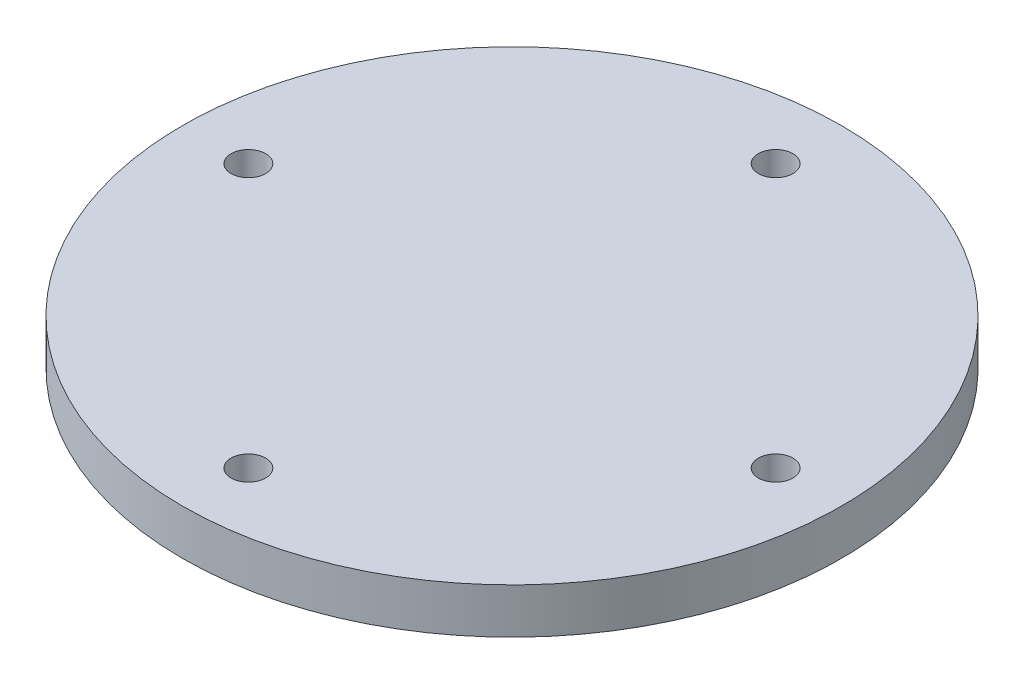
ISO-10303-21;
HEADER;
FILE_DESCRIPTION(('STEP AP214'),'2;1');
FILE_NAME('part.step','',(''),(''),'','','');
FILE_SCHEMA(('AUTOMOTIVE_DESIGN { 1 0 10303 214 1 1 1 1 }'));
ENDSEC;
DATA;
#1=APPLICATION_CONTEXT('core data for automotive mechanical design processes');
#2=APPLICATION_PROTOCOL_DEFINITION('international standard','automotive_design',2000,#1);
#3=PRODUCT_CONTEXT('',#1,'mechanical');
#4=PRODUCT('Part','Part','',(#3));
#5=PRODUCT_RELATED_PRODUCT_CATEGORY('part','',(#4));
#6=PRODUCT_DEFINITION_FORMATION('','',#4);
#7=PRODUCT_DEFINITION_CONTEXT('part definition',#1,'design');
#8=PRODUCT_DEFINITION('design','',#6,#7);
#9=PRODUCT_DEFINITION_SHAPE('','',#8);
#10=(LENGTH_UNIT() NAMED_UNIT(*) SI_UNIT(.MILLI.,.METRE.));
#11=(NAMED_UNIT(*) PLANE_ANGLE_UNIT() SI_UNIT($,.RADIAN.));
#12=(NAMED_UNIT(*) SI_UNIT($,.STERADIAN.) SOLID_ANGLE_UNIT());
#13=UNCERTAINTY_MEASURE_WITH_UNIT(LENGTH_MEASURE(1.E-05),#10,'distance_accuracy_value','');
#14=(GEOMETRIC_REPRESENTATION_CONTEXT(3) GLOBAL_UNCERTAINTY_ASSIGNED_CONTEXT((#13)) GLOBAL_UNIT_ASSIGNED_CONTEXT((#10,
#11,#12)) REPRESENTATION_CONTEXT('',''));
#15=CARTESIAN_POINT('',(0.,0.,0.));
#16=DIRECTION('',(0.,0.,1.));
#17=DIRECTION('',(1.,0.,0.));
#18=AXIS2_PLACEMENT_3D('',#15,#16,#17);
#19=CARTESIAN_POINT('',(0.,6.985,0.));
#20=DIRECTION('',(0.,-1.,0.));
#21=DIRECTION('',(0.,0.,-1.));
#22=AXIS2_PLACEMENT_3D('',#19,#20,#21);
#23=CYLINDRICAL_SURFACE('',#22,50.8);
#24=CARTESIAN_POINT('',(0.,6.985,0.));
#25=DIRECTION('',(0.,1.,0.));
#26=DIRECTION('',(0.,0.,1.));
#27=AXIS2_PLACEMENT_3D('',#24,#25,#26);
#28=CIRCLE('',#27,50.8);
#29=CARTESIAN_POINT('',(0.,6.985,50.8));
#30=VERTEX_POINT('',#29);
#31=EDGE_CURVE('E10',#30,#30,#28,.T.);
#32=ORIENTED_EDGE('',*,*,#31,.F.);
#33=EDGE_LOOP('',(#32));
#34=FACE_BOUND('',#33,.T.);
#35=CARTESIAN_POINT('',(0.,0.,0.));
#36=DIRECTION('',(0.,1.,0.));
#37=DIRECTION('',(0.,0.,1.));
#38=AXIS2_PLACEMENT_3D('',#35,#36,#37);
#39=CIRCLE('',#38,50.8);
#40=CARTESIAN_POINT('',(0.,0.,50.8));
#41=VERTEX_POINT('',#40);
#42=EDGE_CURVE('E40',#41,#41,#39,.T.);
#43=ORIENTED_EDGE('',*,*,#42,.T.);
#44=EDGE_LOOP('',(#43));
#45=FACE_BOUND('',#44,.T.);
#46=ADVANCED_FACE('F37',(#34,#45),#23,.T.);
#47=CARTESIAN_POINT('',(0.,6.985,0.));
#48=DIRECTION('',(0.,1.,0.));
#49=DIRECTION('',(0.,0.,1.));
#50=AXIS2_PLACEMENT_3D('',#47,#48,#49);
#51=PLANE('',#50);
#52=CARTESIAN_POINT('',(0.,6.985,40.64));
#53=DIRECTION('',(0.,1.,0.));
#54=DIRECTION('',(0.,0.,1.));
#55=AXIS2_PLACEMENT_3D('',#52,#53,#54);
#56=CIRCLE('',#55,2.667);
#57=CARTESIAN_POINT('',(0.,6.985,43.307));
#58=VERTEX_POINT('',#57);
#59=EDGE_CURVE('E75',#58,#58,#56,.T.);
#60=ORIENTED_EDGE('',*,*,#59,.F.);
#61=EDGE_LOOP('',(#60));
#62=FACE_BOUND('',#61,.T.);
#63=CARTESIAN_POINT('',(-40.64,6.985,0.));
#64=DIRECTION('',(0.,1.,0.));
#65=DIRECTION('',(0.,0.,1.));
#66=AXIS2_PLACEMENT_3D('',#63,#64,#65);
#67=CIRCLE('',#66,2.66699999999986);
#68=CARTESIAN_POINT('',(-40.64,6.985,2.66699999999986));
#69=VERTEX_POINT('',#68);
#70=EDGE_CURVE('E67',#69,#69,#67,.T.);
#71=ORIENTED_EDGE('',*,*,#70,.F.);
#72=EDGE_LOOP('',(#71));
#73=FACE_BOUND('',#72,.T.);
#74=CARTESIAN_POINT('',(2.8378760322117E-13,6.985,-40.64));
#75=DIRECTION('',(0.,1.,0.));
#76=DIRECTION('',(0.,0.,1.));
#77=AXIS2_PLACEMENT_3D('',#74,#75,#76);
#78=CIRCLE('',#77,2.667);
#79=CARTESIAN_POINT('',(2.8378760322117E-13,6.985,-37.973));
#80=VERTEX_POINT('',#79);
#81=EDGE_CURVE('E59',#80,#80,#78,.T.);
#82=ORIENTED_EDGE('',*,*,#81,.F.);
#83=EDGE_LOOP('',(#82));
#84=FACE_BOUND('',#83,.T.);
#85=CARTESIAN_POINT('',(40.64,6.985,4.25681404831755E-13));
#86=DIRECTION('',(0.,1.,0.));
#87=DIRECTION('',(0.,0.,1.));
#88=AXIS2_PLACEMENT_3D('',#85,#86,#87);
#89=CIRCLE('',#88,2.667);
#90=CARTESIAN_POINT('',(40.64,6.985,2.66700000000043));
#91=VERTEX_POINT('',#90);
#92=EDGE_CURVE('E51',#91,#91,#89,.T.);
#93=ORIENTED_EDGE('',*,*,#92,.F.);
#94=EDGE_LOOP('',(#93));
#95=FACE_BOUND('',#94,.T.);
#96=ORIENTED_EDGE('',*,*,#31,.T.);
#97=EDGE_LOOP('',(#96));
#98=FACE_BOUND('',#97,.T.);
#99=ADVANCED_FACE('F93',(#62,#73,#84,#95,#98),#51,.T.);
#100=CARTESIAN_POINT('',(0.,0.,0.));
#101=DIRECTION('',(0.,1.,0.));
#102=DIRECTION('',(0.,0.,1.));
#103=AXIS2_PLACEMENT_3D('',#100,#101,#102);
#104=PLANE('',#103);
#105=CARTESIAN_POINT('',(0.,0.,40.64));
#106=DIRECTION('',(0.,1.,0.));
#107=DIRECTION('',(0.,0.,1.));
#108=AXIS2_PLACEMENT_3D('',#105,#106,#107);
#109=CIRCLE('',#108,2.667);
#110=CARTESIAN_POINT('',(0.,0.,43.307));
#111=VERTEX_POINT('',#110);
#112=EDGE_CURVE('E49',#111,#111,#109,.T.);
#113=ORIENTED_EDGE('',*,*,#112,.T.);
#114=EDGE_LOOP('',(#113));
#115=FACE_BOUND('',#114,.T.);
#116=CARTESIAN_POINT('',(-40.64,0.,0.));
#117=DIRECTION('',(0.,1.,0.));
#118=DIRECTION('',(0.,0.,1.));
#119=AXIS2_PLACEMENT_3D('',#116,#117,#118);
#120=CIRCLE('',#119,2.66699999999986);
#121=CARTESIAN_POINT('',(-40.64,0.,2.66699999999986));
#122=VERTEX_POINT('',#121);
#123=EDGE_CURVE('E71',#122,#122,#120,.T.);
#124=ORIENTED_EDGE('',*,*,#123,.T.);
#125=EDGE_LOOP('',(#124));
#126=FACE_BOUND('',#125,.T.);
#127=CARTESIAN_POINT('',(2.8378760322117E-13,0.,-40.64));
#128=DIRECTION('',(0.,1.,0.));
#129=DIRECTION('',(0.,0.,1.));
#130=AXIS2_PLACEMENT_3D('',#127,#128,#129);
#131=CIRCLE('',#130,2.667);
#132=CARTESIAN_POINT('',(2.8378760322117E-13,0.,-37.973));
#133=VERTEX_POINT('',#132);
#134=EDGE_CURVE('E63',#133,#133,#131,.T.);
#135=ORIENTED_EDGE('',*,*,#134,.T.);
#136=EDGE_LOOP('',(#135));
#137=FACE_BOUND('',#136,.T.);
#138=CARTESIAN_POINT('',(40.64,0.,4.25681404831755E-13));
#139=DIRECTION('',(0.,1.,0.));
#140=DIRECTION('',(0.,0.,1.));
#141=AXIS2_PLACEMENT_3D('',#138,#139,#140);
#142=CIRCLE('',#141,2.667);
#143=CARTESIAN_POINT('',(40.64,0.,2.66700000000043));
#144=VERTEX_POINT('',#143);
#145=EDGE_CURVE('E55',#144,#144,#142,.T.);
#146=ORIENTED_EDGE('',*,*,#145,.T.);
#147=EDGE_LOOP('',(#146));
#148=FACE_BOUND('',#147,.T.);
#149=ORIENTED_EDGE('',*,*,#42,.F.);
#150=EDGE_LOOP('',(#149));
#151=FACE_BOUND('',#150,.T.);
#152=ADVANCED_FACE('F83',(#115,#126,#137,#148,#151),#104,.F.);
#153=CARTESIAN_POINT('',(40.64,0.,4.25681404831755E-13));
#154=DIRECTION('',(0.,1.,0.));
#155=DIRECTION('',(0.,0.,1.));
#156=AXIS2_PLACEMENT_3D('',#153,#154,#155);
#157=CYLINDRICAL_SURFACE('',#156,2.667);
#158=ORIENTED_EDGE('',*,*,#145,.F.);
#159=EDGE_LOOP('',(#158));
#160=FACE_BOUND('',#159,.T.);
#161=ORIENTED_EDGE('',*,*,#92,.T.);
#162=EDGE_LOOP('',(#161));
#163=FACE_BOUND('',#162,.T.);
#164=ADVANCED_FACE('F103',(#160,#163),#157,.F.);
#165=CARTESIAN_POINT('',(2.8378760322117E-13,0.,-40.64));
#166=DIRECTION('',(0.,1.,0.));
#167=DIRECTION('',(0.,0.,1.));
#168=AXIS2_PLACEMENT_3D('',#165,#166,#167);
#169=CYLINDRICAL_SURFACE('',#168,2.667);
#170=ORIENTED_EDGE('',*,*,#134,.F.);
#171=EDGE_LOOP('',(#170));
#172=FACE_BOUND('',#171,.T.);
#173=ORIENTED_EDGE('',*,*,#81,.T.);
#174=EDGE_LOOP('',(#173));
#175=FACE_BOUND('',#174,.T.);
#176=ADVANCED_FACE('F105',(#172,#175),#169,.F.);
#177=CARTESIAN_POINT('',(-40.64,0.,0.));
#178=DIRECTION('',(0.,1.,0.));
#179=DIRECTION('',(0.,0.,1.));
#180=AXIS2_PLACEMENT_3D('',#177,#178,#179);
#181=CYLINDRICAL_SURFACE('',#180,2.66699999999986);
#182=ORIENTED_EDGE('',*,*,#123,.F.);
#183=EDGE_LOOP('',(#182));
#184=FACE_BOUND('',#183,.T.);
#185=ORIENTED_EDGE('',*,*,#70,.T.);
#186=EDGE_LOOP('',(#185));
#187=FACE_BOUND('',#186,.T.);
#188=ADVANCED_FACE('F89',(#184,#187),#181,.F.);
#189=CARTESIAN_POINT('',(0.,0.,40.64));
#190=DIRECTION('',(0.,1.,0.));
#191=DIRECTION('',(0.,0.,1.));
#192=AXIS2_PLACEMENT_3D('',#189,#190,#191);
#193=CYLINDRICAL_SURFACE('',#192,2.667);
#194=ORIENTED_EDGE('',*,*,#112,.F.);
#195=EDGE_LOOP('',(#194));
#196=FACE_BOUND('',#195,.T.);
#197=ORIENTED_EDGE('',*,*,#59,.T.);
#198=EDGE_LOOP('',(#197));
#199=FACE_BOUND('',#198,.T.);
#200=ADVANCED_FACE('F86',(#196,#199),#193,.F.);
#201=CLOSED_SHELL('',(#46,#99,#152,#164,#176,#188,#200));
#202=MANIFOLD_SOLID_BREP('B2',#201);
#203=ADVANCED_BREP_SHAPE_REPRESENTATION('',(#18,#202),#14);
#204=SHAPE_DEFINITION_REPRESENTATION(#9,#203);
ENDSEC;
END-ISO-10303-21;
